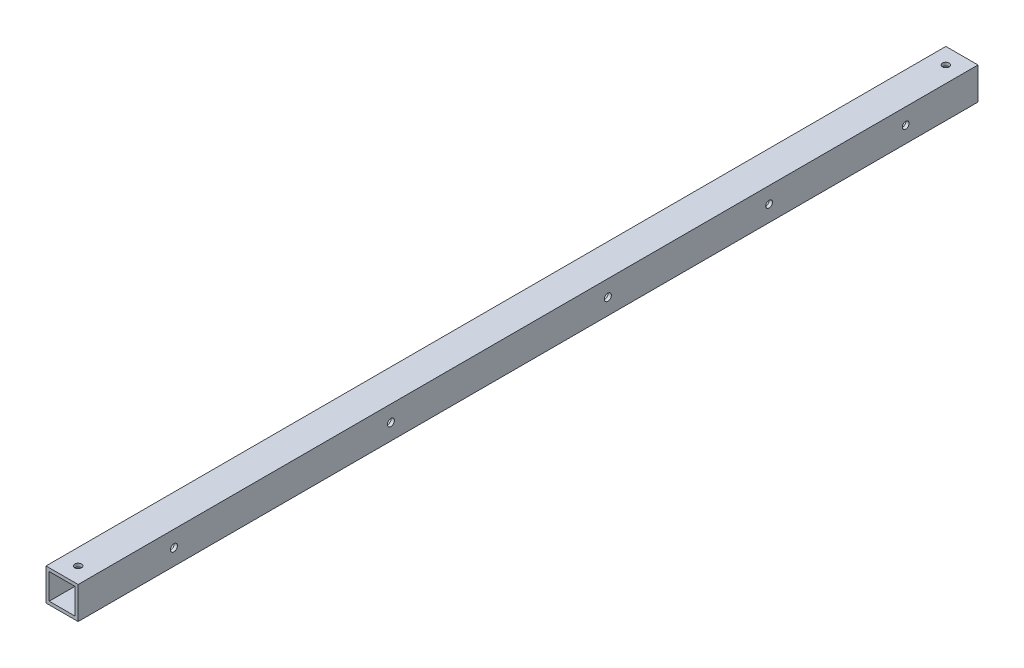
ISO-10303-21;
HEADER;
FILE_DESCRIPTION(('STEP AP214'),'2;1');
FILE_NAME('part.step','',(''),(''),'','','');
FILE_SCHEMA(('AUTOMOTIVE_DESIGN { 1 0 10303 214 1 1 1 1 }'));
ENDSEC;
DATA;
#1=APPLICATION_CONTEXT('core data for automotive mechanical design processes');
#2=APPLICATION_PROTOCOL_DEFINITION('international standard','automotive_design',2000,#1);
#3=PRODUCT_CONTEXT('',#1,'mechanical');
#4=PRODUCT('Part','Part','',(#3));
#5=PRODUCT_RELATED_PRODUCT_CATEGORY('part','',(#4));
#6=PRODUCT_DEFINITION_FORMATION('','',#4);
#7=PRODUCT_DEFINITION_CONTEXT('part definition',#1,'design');
#8=PRODUCT_DEFINITION('design','',#6,#7);
#9=PRODUCT_DEFINITION_SHAPE('','',#8);
#10=(LENGTH_UNIT() NAMED_UNIT(*) SI_UNIT(.MILLI.,.METRE.));
#11=(NAMED_UNIT(*) PLANE_ANGLE_UNIT() SI_UNIT($,.RADIAN.));
#12=(NAMED_UNIT(*) SI_UNIT($,.STERADIAN.) SOLID_ANGLE_UNIT());
#13=UNCERTAINTY_MEASURE_WITH_UNIT(LENGTH_MEASURE(1.E-05),#10,'distance_accuracy_value','');
#14=(GEOMETRIC_REPRESENTATION_CONTEXT(3) GLOBAL_UNCERTAINTY_ASSIGNED_CONTEXT((#13)) GLOBAL_UNIT_ASSIGNED_CONTEXT((#10,
#11,#12)) REPRESENTATION_CONTEXT('',''));
#15=CARTESIAN_POINT('',(0.,0.,0.));
#16=DIRECTION('',(0.,0.,1.));
#17=DIRECTION('',(1.,0.,0.));
#18=AXIS2_PLACEMENT_3D('',#15,#16,#17);
#19=CARTESIAN_POINT('',(0.,0.,560.));
#20=DIRECTION('',(0.,0.,1.));
#21=DIRECTION('',(1.,0.,0.));
#22=AXIS2_PLACEMENT_3D('',#19,#20,#21);
#23=PLANE('',#22);
#24=DIRECTION('',(0.,1.,0.));
#25=VECTOR('',#24,1.);
#26=CARTESIAN_POINT('',(10.,10.,560.));
#27=LINE('',#26,#25);
#28=CARTESIAN_POINT('',(10.,-10.,560.));
#29=VERTEX_POINT('',#28);
#30=CARTESIAN_POINT('',(10.,10.,560.));
#31=VERTEX_POINT('',#30);
#32=EDGE_CURVE('E137',#29,#31,#27,.T.);
#33=ORIENTED_EDGE('',*,*,#32,.T.);
#34=DIRECTION('',(-1.,0.,0.));
#35=VECTOR('',#34,1.);
#36=CARTESIAN_POINT('',(-10.,10.,560.));
#37=LINE('',#36,#35);
#38=CARTESIAN_POINT('',(-10.,10.,560.));
#39=VERTEX_POINT('',#38);
#40=EDGE_CURVE('E140',#31,#39,#37,.T.);
#41=ORIENTED_EDGE('',*,*,#40,.T.);
#42=DIRECTION('',(0.,-1.,0.));
#43=VECTOR('',#42,1.);
#44=CARTESIAN_POINT('',(-10.,10.,560.));
#45=LINE('',#44,#43);
#46=CARTESIAN_POINT('',(-10.,-10.,560.));
#47=VERTEX_POINT('',#46);
#48=EDGE_CURVE('E143',#39,#47,#45,.T.);
#49=ORIENTED_EDGE('',*,*,#48,.T.);
#50=DIRECTION('',(1.,0.,0.));
#51=VECTOR('',#50,1.);
#52=CARTESIAN_POINT('',(-10.,-10.,560.));
#53=LINE('',#52,#51);
#54=EDGE_CURVE('E145',#47,#29,#53,.T.);
#55=ORIENTED_EDGE('',*,*,#54,.T.);
#56=EDGE_LOOP('',(#33,#41,#49,#55));
#57=FACE_BOUND('',#56,.T.);
#58=DIRECTION('',(-1.,0.,0.));
#59=VECTOR('',#58,1.);
#60=CARTESIAN_POINT('',(-8.,8.,560.));
#61=LINE('',#60,#59);
#62=CARTESIAN_POINT('',(8.,8.,560.));
#63=VERTEX_POINT('',#62);
#64=CARTESIAN_POINT('',(-8.,8.,560.));
#65=VERTEX_POINT('',#64);
#66=EDGE_CURVE('E107',#63,#65,#61,.T.);
#67=ORIENTED_EDGE('',*,*,#66,.F.);
#68=DIRECTION('',(0.,1.,0.));
#69=VECTOR('',#68,1.);
#70=CARTESIAN_POINT('',(8.,8.,560.));
#71=LINE('',#70,#69);
#72=CARTESIAN_POINT('',(8.,-8.,560.));
#73=VERTEX_POINT('',#72);
#74=EDGE_CURVE('E99',#73,#63,#71,.T.);
#75=ORIENTED_EDGE('',*,*,#74,.F.);
#76=DIRECTION('',(1.,0.,0.));
#77=VECTOR('',#76,1.);
#78=CARTESIAN_POINT('',(-8.,-8.,560.));
#79=LINE('',#78,#77);
#80=CARTESIAN_POINT('',(-8.,-8.,560.));
#81=VERTEX_POINT('',#80);
#82=EDGE_CURVE('E121',#81,#73,#79,.T.);
#83=ORIENTED_EDGE('',*,*,#82,.F.);
#84=DIRECTION('',(0.,-1.,0.));
#85=VECTOR('',#84,1.);
#86=CARTESIAN_POINT('',(-8.,8.,560.));
#87=LINE('',#86,#85);
#88=EDGE_CURVE('E119',#65,#81,#87,.T.);
#89=ORIENTED_EDGE('',*,*,#88,.F.);
#90=EDGE_LOOP('',(#67,#75,#83,#89));
#91=FACE_BOUND('',#90,.T.);
#92=ADVANCED_FACE('F32',(#57,#91),#23,.T.);
#93=CARTESIAN_POINT('',(0.,0.,0.));
#94=DIRECTION('',(0.,0.,1.));
#95=DIRECTION('',(1.,0.,0.));
#96=AXIS2_PLACEMENT_3D('',#93,#94,#95);
#97=PLANE('',#96);
#98=DIRECTION('',(0.,1.,0.));
#99=VECTOR('',#98,1.);
#100=CARTESIAN_POINT('',(10.,10.,0.));
#101=LINE('',#100,#99);
#102=CARTESIAN_POINT('',(10.,-10.,0.));
#103=VERTEX_POINT('',#102);
#104=CARTESIAN_POINT('',(10.,10.,0.));
#105=VERTEX_POINT('',#104);
#106=EDGE_CURVE('E115',#103,#105,#101,.T.);
#107=ORIENTED_EDGE('',*,*,#106,.F.);
#108=DIRECTION('',(1.,0.,0.));
#109=VECTOR('',#108,1.);
#110=CARTESIAN_POINT('',(-10.,-10.,0.));
#111=LINE('',#110,#109);
#112=CARTESIAN_POINT('',(-10.,-10.,0.));
#113=VERTEX_POINT('',#112);
#114=EDGE_CURVE('E141',#113,#103,#111,.T.);
#115=ORIENTED_EDGE('',*,*,#114,.F.);
#116=DIRECTION('',(0.,-1.,0.));
#117=VECTOR('',#116,1.);
#118=CARTESIAN_POINT('',(-10.,10.,0.));
#119=LINE('',#118,#117);
#120=CARTESIAN_POINT('',(-10.,10.,0.));
#121=VERTEX_POINT('',#120);
#122=EDGE_CURVE('E152',#121,#113,#119,.T.);
#123=ORIENTED_EDGE('',*,*,#122,.F.);
#124=DIRECTION('',(-1.,0.,0.));
#125=VECTOR('',#124,1.);
#126=CARTESIAN_POINT('',(-10.,10.,0.));
#127=LINE('',#126,#125);
#128=EDGE_CURVE('E150',#105,#121,#127,.T.);
#129=ORIENTED_EDGE('',*,*,#128,.F.);
#130=EDGE_LOOP('',(#107,#115,#123,#129));
#131=FACE_BOUND('',#130,.T.);
#132=DIRECTION('',(0.,1.,0.));
#133=VECTOR('',#132,1.);
#134=CARTESIAN_POINT('',(8.,8.,0.));
#135=LINE('',#134,#133);
#136=CARTESIAN_POINT('',(8.,-8.,0.));
#137=VERTEX_POINT('',#136);
#138=CARTESIAN_POINT('',(8.,8.,0.));
#139=VERTEX_POINT('',#138);
#140=EDGE_CURVE('E57',#137,#139,#135,.T.);
#141=ORIENTED_EDGE('',*,*,#140,.T.);
#142=DIRECTION('',(-1.,0.,0.));
#143=VECTOR('',#142,1.);
#144=CARTESIAN_POINT('',(-8.,8.,0.));
#145=LINE('',#144,#143);
#146=CARTESIAN_POINT('',(-8.,8.,0.));
#147=VERTEX_POINT('',#146);
#148=EDGE_CURVE('E114',#139,#147,#145,.T.);
#149=ORIENTED_EDGE('',*,*,#148,.T.);
#150=DIRECTION('',(0.,-1.,0.));
#151=VECTOR('',#150,1.);
#152=CARTESIAN_POINT('',(-8.,8.,0.));
#153=LINE('',#152,#151);
#154=CARTESIAN_POINT('',(-8.,-8.,0.));
#155=VERTEX_POINT('',#154);
#156=EDGE_CURVE('E129',#147,#155,#153,.T.);
#157=ORIENTED_EDGE('',*,*,#156,.T.);
#158=DIRECTION('',(1.,0.,0.));
#159=VECTOR('',#158,1.);
#160=CARTESIAN_POINT('',(-8.,-8.,0.));
#161=LINE('',#160,#159);
#162=EDGE_CURVE('E108',#155,#137,#161,.T.);
#163=ORIENTED_EDGE('',*,*,#162,.T.);
#164=EDGE_LOOP('',(#141,#149,#157,#163));
#165=FACE_BOUND('',#164,.T.);
#166=ADVANCED_FACE('F249',(#131,#165),#97,.F.);
#167=CARTESIAN_POINT('',(10.,10.,560.));
#168=DIRECTION('',(-1.,0.,0.));
#169=DIRECTION('',(0.,-1.,0.));
#170=AXIS2_PLACEMENT_3D('',#167,#168,#169);
#171=PLANE('',#170);
#172=CARTESIAN_POINT('',(10.,0.,130.));
#173=DIRECTION('',(1.,0.,0.));
#174=DIRECTION('',(0.,1.,0.));
#175=AXIS2_PLACEMENT_3D('',#172,#173,#174);
#176=CIRCLE('',#175,2.09999999999999);
#177=CARTESIAN_POINT('',(10.,2.09999999999998,130.));
#178=VERTEX_POINT('',#177);
#179=EDGE_CURVE('E183',#178,#178,#176,.T.);
#180=ORIENTED_EDGE('',*,*,#179,.F.);
#181=EDGE_LOOP('',(#180));
#182=FACE_BOUND('',#181,.T.);
#183=CARTESIAN_POINT('',(10.,0.,45.));
#184=DIRECTION('',(1.,0.,0.));
#185=DIRECTION('',(0.,1.,0.));
#186=AXIS2_PLACEMENT_3D('',#183,#184,#185);
#187=CIRCLE('',#186,2.1);
#188=CARTESIAN_POINT('',(10.,2.1,45.));
#189=VERTEX_POINT('',#188);
#190=EDGE_CURVE('E190',#189,#189,#187,.T.);
#191=ORIENTED_EDGE('',*,*,#190,.F.);
#192=EDGE_LOOP('',(#191));
#193=FACE_BOUND('',#192,.T.);
#194=CARTESIAN_POINT('',(10.,0.,500.38));
#195=DIRECTION('',(1.,0.,0.));
#196=DIRECTION('',(0.,1.,0.));
#197=AXIS2_PLACEMENT_3D('',#194,#195,#196);
#198=CIRCLE('',#197,2.19999999999998);
#199=CARTESIAN_POINT('',(10.,2.19999999999999,500.38));
#200=VERTEX_POINT('',#199);
#201=EDGE_CURVE('E208',#200,#200,#198,.T.);
#202=ORIENTED_EDGE('',*,*,#201,.F.);
#203=EDGE_LOOP('',(#202));
#204=FACE_BOUND('',#203,.T.);
#205=CARTESIAN_POINT('',(10.,0.,365.38));
#206=DIRECTION('',(1.,0.,0.));
#207=DIRECTION('',(0.,1.,0.));
#208=AXIS2_PLACEMENT_3D('',#205,#206,#207);
#209=CIRCLE('',#208,2.19999999999998);
#210=CARTESIAN_POINT('',(10.,2.19999999999999,365.38));
#211=VERTEX_POINT('',#210);
#212=EDGE_CURVE('E214',#211,#211,#209,.T.);
#213=ORIENTED_EDGE('',*,*,#212,.F.);
#214=EDGE_LOOP('',(#213));
#215=FACE_BOUND('',#214,.T.);
#216=CARTESIAN_POINT('',(10.,0.,230.38));
#217=DIRECTION('',(1.,0.,0.));
#218=DIRECTION('',(0.,1.,0.));
#219=AXIS2_PLACEMENT_3D('',#216,#217,#218);
#220=CIRCLE('',#219,2.20000000000001);
#221=CARTESIAN_POINT('',(10.,2.20000000000002,230.38));
#222=VERTEX_POINT('',#221);
#223=EDGE_CURVE('E205',#222,#222,#220,.T.);
#224=ORIENTED_EDGE('',*,*,#223,.F.);
#225=EDGE_LOOP('',(#224));
#226=FACE_BOUND('',#225,.T.);
#227=ORIENTED_EDGE('',*,*,#106,.T.);
#228=DIRECTION('',(0.,0.,-1.));
#229=VECTOR('',#228,1.);
#230=CARTESIAN_POINT('',(10.,10.,560.));
#231=LINE('',#230,#229);
#232=EDGE_CURVE('E11',#31,#105,#231,.T.);
#233=ORIENTED_EDGE('',*,*,#232,.F.);
#234=ORIENTED_EDGE('',*,*,#32,.F.);
#235=DIRECTION('',(0.,0.,-1.));
#236=VECTOR('',#235,1.);
#237=CARTESIAN_POINT('',(10.,-10.,560.));
#238=LINE('',#237,#236);
#239=EDGE_CURVE('E147',#29,#103,#238,.T.);
#240=ORIENTED_EDGE('',*,*,#239,.T.);
#241=EDGE_LOOP('',(#227,#233,#234,#240));
#242=FACE_BOUND('',#241,.T.);
#243=ADVANCED_FACE('F34',(#182,#193,#204,#215,#226,#242),#171,.F.);
#244=CARTESIAN_POINT('',(-10.,10.,560.));
#245=DIRECTION('',(0.,-1.,0.));
#246=DIRECTION('',(0.,0.,-1.));
#247=AXIS2_PLACEMENT_3D('',#244,#245,#246);
#248=PLANE('',#247);
#249=CARTESIAN_POINT('',(0.,10.,550.));
#250=DIRECTION('',(0.,1.,0.));
#251=DIRECTION('',(0.,0.,1.));
#252=AXIS2_PLACEMENT_3D('',#249,#250,#251);
#253=CIRCLE('',#252,2.10000000000001);
#254=CARTESIAN_POINT('',(0.,10.,552.1));
#255=VERTEX_POINT('',#254);
#256=EDGE_CURVE('E165',#255,#255,#253,.T.);
#257=ORIENTED_EDGE('',*,*,#256,.F.);
#258=EDGE_LOOP('',(#257));
#259=FACE_BOUND('',#258,.T.);
#260=CARTESIAN_POINT('',(0.,10.,10.));
#261=DIRECTION('',(0.,1.,0.));
#262=DIRECTION('',(0.,0.,1.));
#263=AXIS2_PLACEMENT_3D('',#260,#261,#262);
#264=CIRCLE('',#263,2.1);
#265=CARTESIAN_POINT('',(0.,10.,12.1));
#266=VERTEX_POINT('',#265);
#267=EDGE_CURVE('E228',#266,#266,#264,.T.);
#268=ORIENTED_EDGE('',*,*,#267,.F.);
#269=EDGE_LOOP('',(#268));
#270=FACE_BOUND('',#269,.T.);
#271=ORIENTED_EDGE('',*,*,#128,.T.);
#272=DIRECTION('',(0.,0.,-1.));
#273=VECTOR('',#272,1.);
#274=CARTESIAN_POINT('',(-10.,10.,560.));
#275=LINE('',#274,#273);
#276=EDGE_CURVE('E41',#39,#121,#275,.T.);
#277=ORIENTED_EDGE('',*,*,#276,.F.);
#278=ORIENTED_EDGE('',*,*,#40,.F.);
#279=ORIENTED_EDGE('',*,*,#232,.T.);
#280=EDGE_LOOP('',(#271,#277,#278,#279));
#281=FACE_BOUND('',#280,.T.);
#282=ADVANCED_FACE('F235',(#259,#270,#281),#248,.F.);
#283=CARTESIAN_POINT('',(-10.,10.,560.));
#284=DIRECTION('',(1.,0.,0.));
#285=DIRECTION('',(0.,1.,0.));
#286=AXIS2_PLACEMENT_3D('',#283,#284,#285);
#287=PLANE('',#286);
#288=CARTESIAN_POINT('',(-10.,0.,130.));
#289=DIRECTION('',(1.,0.,0.));
#290=DIRECTION('',(0.,1.,0.));
#291=AXIS2_PLACEMENT_3D('',#288,#289,#290);
#292=CIRCLE('',#291,2.09999999999999);
#293=CARTESIAN_POINT('',(-10.,2.09999999999998,130.));
#294=VERTEX_POINT('',#293);
#295=EDGE_CURVE('E202',#294,#294,#292,.T.);
#296=ORIENTED_EDGE('',*,*,#295,.T.);
#297=EDGE_LOOP('',(#296));
#298=FACE_BOUND('',#297,.T.);
#299=CARTESIAN_POINT('',(-10.,0.,45.));
#300=DIRECTION('',(1.,0.,0.));
#301=DIRECTION('',(0.,1.,0.));
#302=AXIS2_PLACEMENT_3D('',#299,#300,#301);
#303=CIRCLE('',#302,2.1);
#304=CARTESIAN_POINT('',(-10.,2.1,45.));
#305=VERTEX_POINT('',#304);
#306=EDGE_CURVE('E187',#305,#305,#303,.T.);
#307=ORIENTED_EDGE('',*,*,#306,.T.);
#308=EDGE_LOOP('',(#307));
#309=FACE_BOUND('',#308,.T.);
#310=CARTESIAN_POINT('',(-10.,0.,500.38));
#311=DIRECTION('',(1.,0.,0.));
#312=DIRECTION('',(0.,1.,0.));
#313=AXIS2_PLACEMENT_3D('',#310,#311,#312);
#314=CIRCLE('',#313,2.19999999999998);
#315=CARTESIAN_POINT('',(-10.,2.19999999999998,500.38));
#316=VERTEX_POINT('',#315);
#317=EDGE_CURVE('E172',#316,#316,#314,.T.);
#318=ORIENTED_EDGE('',*,*,#317,.T.);
#319=EDGE_LOOP('',(#318));
#320=FACE_BOUND('',#319,.T.);
#321=CARTESIAN_POINT('',(-10.,0.,365.38));
#322=DIRECTION('',(1.,0.,0.));
#323=DIRECTION('',(0.,1.,0.));
#324=AXIS2_PLACEMENT_3D('',#321,#322,#323);
#325=CIRCLE('',#324,2.19999999999998);
#326=CARTESIAN_POINT('',(-10.,2.19999999999998,365.38));
#327=VERTEX_POINT('',#326);
#328=EDGE_CURVE('E211',#327,#327,#325,.T.);
#329=ORIENTED_EDGE('',*,*,#328,.T.);
#330=EDGE_LOOP('',(#329));
#331=FACE_BOUND('',#330,.T.);
#332=CARTESIAN_POINT('',(-10.,0.,230.38));
#333=DIRECTION('',(1.,0.,0.));
#334=DIRECTION('',(0.,1.,0.));
#335=AXIS2_PLACEMENT_3D('',#332,#333,#334);
#336=CIRCLE('',#335,2.20000000000001);
#337=CARTESIAN_POINT('',(-10.,2.20000000000001,230.38));
#338=VERTEX_POINT('',#337);
#339=EDGE_CURVE('E217',#338,#338,#336,.T.);
#340=ORIENTED_EDGE('',*,*,#339,.T.);
#341=EDGE_LOOP('',(#340));
#342=FACE_BOUND('',#341,.T.);
#343=ORIENTED_EDGE('',*,*,#122,.T.);
#344=DIRECTION('',(0.,0.,-1.));
#345=VECTOR('',#344,1.);
#346=CARTESIAN_POINT('',(-10.,-10.,560.));
#347=LINE('',#346,#345);
#348=EDGE_CURVE('E157',#47,#113,#347,.T.);
#349=ORIENTED_EDGE('',*,*,#348,.F.);
#350=ORIENTED_EDGE('',*,*,#48,.F.);
#351=ORIENTED_EDGE('',*,*,#276,.T.);
#352=EDGE_LOOP('',(#343,#349,#350,#351));
#353=FACE_BOUND('',#352,.T.);
#354=ADVANCED_FACE('F238',(#298,#309,#320,#331,#342,#353),#287,.F.);
#355=CARTESIAN_POINT('',(-10.,-10.,560.));
#356=DIRECTION('',(0.,1.,0.));
#357=DIRECTION('',(0.,0.,1.));
#358=AXIS2_PLACEMENT_3D('',#355,#356,#357);
#359=PLANE('',#358);
#360=ORIENTED_EDGE('',*,*,#114,.T.);
#361=ORIENTED_EDGE('',*,*,#239,.F.);
#362=ORIENTED_EDGE('',*,*,#54,.F.);
#363=ORIENTED_EDGE('',*,*,#348,.T.);
#364=EDGE_LOOP('',(#360,#361,#362,#363));
#365=FACE_BOUND('',#364,.T.);
#366=ADVANCED_FACE('F253',(#365),#359,.F.);
#367=CARTESIAN_POINT('',(8.,8.,560.));
#368=DIRECTION('',(-1.,0.,0.));
#369=DIRECTION('',(0.,-1.,0.));
#370=AXIS2_PLACEMENT_3D('',#367,#368,#369);
#371=PLANE('',#370);
#372=CARTESIAN_POINT('',(8.,0.,130.));
#373=DIRECTION('',(-1.,0.,0.));
#374=DIRECTION('',(0.,-1.,0.));
#375=AXIS2_PLACEMENT_3D('',#372,#373,#374);
#376=CIRCLE('',#375,2.09999999999999);
#377=CARTESIAN_POINT('',(8.,-2.1,130.));
#378=VERTEX_POINT('',#377);
#379=EDGE_CURVE('E199',#378,#378,#376,.T.);
#380=ORIENTED_EDGE('',*,*,#379,.F.);
#381=EDGE_LOOP('',(#380));
#382=FACE_BOUND('',#381,.T.);
#383=CARTESIAN_POINT('',(8.,0.,45.));
#384=DIRECTION('',(-1.,0.,0.));
#385=DIRECTION('',(0.,-1.,0.));
#386=AXIS2_PLACEMENT_3D('',#383,#384,#385);
#387=CIRCLE('',#386,2.1);
#388=CARTESIAN_POINT('',(8.,-2.09999999999999,45.));
#389=VERTEX_POINT('',#388);
#390=EDGE_CURVE('E182',#389,#389,#387,.T.);
#391=ORIENTED_EDGE('',*,*,#390,.F.);
#392=EDGE_LOOP('',(#391));
#393=FACE_BOUND('',#392,.T.);
#394=CARTESIAN_POINT('',(8.,0.,500.38));
#395=DIRECTION('',(-1.,0.,0.));
#396=DIRECTION('',(0.,-1.,0.));
#397=AXIS2_PLACEMENT_3D('',#394,#395,#396);
#398=CIRCLE('',#397,2.19999999999998);
#399=CARTESIAN_POINT('',(8.,-2.19999999999998,500.38));
#400=VERTEX_POINT('',#399);
#401=EDGE_CURVE('E179',#400,#400,#398,.T.);
#402=ORIENTED_EDGE('',*,*,#401,.F.);
#403=EDGE_LOOP('',(#402));
#404=FACE_BOUND('',#403,.T.);
#405=CARTESIAN_POINT('',(8.,0.,365.38));
#406=DIRECTION('',(-1.,0.,0.));
#407=DIRECTION('',(0.,-1.,0.));
#408=AXIS2_PLACEMENT_3D('',#405,#406,#407);
#409=CIRCLE('',#408,2.19999999999998);
#410=CARTESIAN_POINT('',(8.,-2.19999999999998,365.38));
#411=VERTEX_POINT('',#410);
#412=EDGE_CURVE('E176',#411,#411,#409,.T.);
#413=ORIENTED_EDGE('',*,*,#412,.F.);
#414=EDGE_LOOP('',(#413));
#415=FACE_BOUND('',#414,.T.);
#416=CARTESIAN_POINT('',(8.,0.,230.38));
#417=DIRECTION('',(-1.,0.,0.));
#418=DIRECTION('',(0.,-1.,0.));
#419=AXIS2_PLACEMENT_3D('',#416,#417,#418);
#420=CIRCLE('',#419,2.20000000000001);
#421=CARTESIAN_POINT('',(8.,-2.20000000000001,230.38));
#422=VERTEX_POINT('',#421);
#423=EDGE_CURVE('E171',#422,#422,#420,.T.);
#424=ORIENTED_EDGE('',*,*,#423,.F.);
#425=EDGE_LOOP('',(#424));
#426=FACE_BOUND('',#425,.T.);
#427=ORIENTED_EDGE('',*,*,#140,.F.);
#428=DIRECTION('',(0.,0.,-1.));
#429=VECTOR('',#428,1.);
#430=CARTESIAN_POINT('',(8.,-8.,560.));
#431=LINE('',#430,#429);
#432=EDGE_CURVE('E103',#73,#137,#431,.T.);
#433=ORIENTED_EDGE('',*,*,#432,.F.);
#434=ORIENTED_EDGE('',*,*,#74,.T.);
#435=DIRECTION('',(0.,0.,-1.));
#436=VECTOR('',#435,1.);
#437=CARTESIAN_POINT('',(8.,8.,560.));
#438=LINE('',#437,#436);
#439=EDGE_CURVE('E102',#63,#139,#438,.T.);
#440=ORIENTED_EDGE('',*,*,#439,.T.);
#441=EDGE_LOOP('',(#427,#433,#434,#440));
#442=FACE_BOUND('',#441,.T.);
#443=ADVANCED_FACE('F101',(#382,#393,#404,#415,#426,#442),#371,.T.);
#444=CARTESIAN_POINT('',(-8.,8.,560.));
#445=DIRECTION('',(0.,-1.,0.));
#446=DIRECTION('',(0.,0.,-1.));
#447=AXIS2_PLACEMENT_3D('',#444,#445,#446);
#448=PLANE('',#447);
#449=CARTESIAN_POINT('',(0.,8.,550.));
#450=DIRECTION('',(0.,-1.,0.));
#451=DIRECTION('',(0.,0.,-1.));
#452=AXIS2_PLACEMENT_3D('',#449,#450,#451);
#453=CIRCLE('',#452,2.10000000000001);
#454=CARTESIAN_POINT('',(0.,8.,547.9));
#455=VERTEX_POINT('',#454);
#456=EDGE_CURVE('E127',#455,#455,#453,.T.);
#457=ORIENTED_EDGE('',*,*,#456,.F.);
#458=EDGE_LOOP('',(#457));
#459=FACE_BOUND('',#458,.T.);
#460=CARTESIAN_POINT('',(0.,8.,10.));
#461=DIRECTION('',(0.,-1.,0.));
#462=DIRECTION('',(0.,0.,-1.));
#463=AXIS2_PLACEMENT_3D('',#460,#461,#462);
#464=CIRCLE('',#463,2.1);
#465=CARTESIAN_POINT('',(0.,8.,7.9));
#466=VERTEX_POINT('',#465);
#467=EDGE_CURVE('E162',#466,#466,#464,.T.);
#468=ORIENTED_EDGE('',*,*,#467,.F.);
#469=EDGE_LOOP('',(#468));
#470=FACE_BOUND('',#469,.T.);
#471=ORIENTED_EDGE('',*,*,#148,.F.);
#472=ORIENTED_EDGE('',*,*,#439,.F.);
#473=ORIENTED_EDGE('',*,*,#66,.T.);
#474=DIRECTION('',(0.,0.,-1.));
#475=VECTOR('',#474,1.);
#476=CARTESIAN_POINT('',(-8.,8.,560.));
#477=LINE('',#476,#475);
#478=EDGE_CURVE('E116',#65,#147,#477,.T.);
#479=ORIENTED_EDGE('',*,*,#478,.T.);
#480=EDGE_LOOP('',(#471,#472,#473,#479));
#481=FACE_BOUND('',#480,.T.);
#482=ADVANCED_FACE('F111',(#459,#470,#481),#448,.T.);
#483=CARTESIAN_POINT('',(-8.,8.,560.));
#484=DIRECTION('',(1.,0.,0.));
#485=DIRECTION('',(0.,0.,-1.));
#486=AXIS2_PLACEMENT_3D('',#483,#484,#485);
#487=PLANE('',#486);
#488=CARTESIAN_POINT('',(-8.,0.,130.));
#489=DIRECTION('',(1.,0.,0.));
#490=DIRECTION('',(0.,0.,-1.));
#491=AXIS2_PLACEMENT_3D('',#488,#489,#490);
#492=CIRCLE('',#491,2.09999999999999);
#493=CARTESIAN_POINT('',(-8.,0.,127.9));
#494=VERTEX_POINT('',#493);
#495=EDGE_CURVE('E36',#494,#494,#492,.T.);
#496=ORIENTED_EDGE('',*,*,#495,.F.);
#497=EDGE_LOOP('',(#496));
#498=FACE_BOUND('',#497,.T.);
#499=CARTESIAN_POINT('',(-8.,0.,45.));
#500=DIRECTION('',(1.,0.,0.));
#501=DIRECTION('',(0.,0.,-1.));
#502=AXIS2_PLACEMENT_3D('',#499,#500,#501);
#503=CIRCLE('',#502,2.1);
#504=CARTESIAN_POINT('',(-8.,0.,42.9));
#505=VERTEX_POINT('',#504);
#506=EDGE_CURVE('E180',#505,#505,#503,.T.);
#507=ORIENTED_EDGE('',*,*,#506,.F.);
#508=EDGE_LOOP('',(#507));
#509=FACE_BOUND('',#508,.T.);
#510=CARTESIAN_POINT('',(-8.,0.,500.38));
#511=DIRECTION('',(1.,0.,0.));
#512=DIRECTION('',(0.,0.,-1.));
#513=AXIS2_PLACEMENT_3D('',#510,#511,#512);
#514=CIRCLE('',#513,2.19999999999998);
#515=CARTESIAN_POINT('',(-8.,0.,498.18));
#516=VERTEX_POINT('',#515);
#517=EDGE_CURVE('E177',#516,#516,#514,.T.);
#518=ORIENTED_EDGE('',*,*,#517,.F.);
#519=EDGE_LOOP('',(#518));
#520=FACE_BOUND('',#519,.T.);
#521=CARTESIAN_POINT('',(-8.,0.,365.38));
#522=DIRECTION('',(1.,0.,0.));
#523=DIRECTION('',(0.,0.,-1.));
#524=AXIS2_PLACEMENT_3D('',#521,#522,#523);
#525=CIRCLE('',#524,2.19999999999998);
#526=CARTESIAN_POINT('',(-8.,0.,363.18));
#527=VERTEX_POINT('',#526);
#528=EDGE_CURVE('E173',#527,#527,#525,.T.);
#529=ORIENTED_EDGE('',*,*,#528,.F.);
#530=EDGE_LOOP('',(#529));
#531=FACE_BOUND('',#530,.T.);
#532=CARTESIAN_POINT('',(-8.,0.,230.38));
#533=DIRECTION('',(1.,0.,0.));
#534=DIRECTION('',(0.,0.,-1.));
#535=AXIS2_PLACEMENT_3D('',#532,#533,#534);
#536=CIRCLE('',#535,2.20000000000001);
#537=CARTESIAN_POINT('',(-8.,0.,228.18));
#538=VERTEX_POINT('',#537);
#539=EDGE_CURVE('E168',#538,#538,#536,.T.);
#540=ORIENTED_EDGE('',*,*,#539,.F.);
#541=EDGE_LOOP('',(#540));
#542=FACE_BOUND('',#541,.T.);
#543=ORIENTED_EDGE('',*,*,#156,.F.);
#544=ORIENTED_EDGE('',*,*,#478,.F.);
#545=ORIENTED_EDGE('',*,*,#88,.T.);
#546=DIRECTION('',(0.,0.,-1.));
#547=VECTOR('',#546,1.);
#548=CARTESIAN_POINT('',(-8.,-8.,560.));
#549=LINE('',#548,#547);
#550=EDGE_CURVE('E49',#81,#155,#549,.T.);
#551=ORIENTED_EDGE('',*,*,#550,.T.);
#552=EDGE_LOOP('',(#543,#544,#545,#551));
#553=FACE_BOUND('',#552,.T.);
#554=ADVANCED_FACE('F364',(#498,#509,#520,#531,#542,#553),#487,.T.);
#555=CARTESIAN_POINT('',(-8.,-8.,560.));
#556=DIRECTION('',(0.,1.,0.));
#557=DIRECTION('',(0.,0.,1.));
#558=AXIS2_PLACEMENT_3D('',#555,#556,#557);
#559=PLANE('',#558);
#560=ORIENTED_EDGE('',*,*,#162,.F.);
#561=ORIENTED_EDGE('',*,*,#550,.F.);
#562=ORIENTED_EDGE('',*,*,#82,.T.);
#563=ORIENTED_EDGE('',*,*,#432,.T.);
#564=EDGE_LOOP('',(#560,#561,#562,#563));
#565=FACE_BOUND('',#564,.T.);
#566=ADVANCED_FACE('F369',(#565),#559,.T.);
#567=CARTESIAN_POINT('',(0.,0.,10.));
#568=DIRECTION('',(0.,1.,0.));
#569=DIRECTION('',(0.,0.,1.));
#570=AXIS2_PLACEMENT_3D('',#567,#568,#569);
#571=CYLINDRICAL_SURFACE('',#570,2.1);
#572=ORIENTED_EDGE('',*,*,#467,.T.);
#573=EDGE_LOOP('',(#572));
#574=FACE_BOUND('',#573,.T.);
#575=ORIENTED_EDGE('',*,*,#267,.T.);
#576=EDGE_LOOP('',(#575));
#577=FACE_BOUND('',#576,.T.);
#578=ADVANCED_FACE('F233',(#574,#577),#571,.F.);
#579=CARTESIAN_POINT('',(0.,0.,550.));
#580=DIRECTION('',(0.,1.,0.));
#581=DIRECTION('',(0.,0.,1.));
#582=AXIS2_PLACEMENT_3D('',#579,#580,#581);
#583=CYLINDRICAL_SURFACE('',#582,2.10000000000001);
#584=ORIENTED_EDGE('',*,*,#456,.T.);
#585=EDGE_LOOP('',(#584));
#586=FACE_BOUND('',#585,.T.);
#587=ORIENTED_EDGE('',*,*,#256,.T.);
#588=EDGE_LOOP('',(#587));
#589=FACE_BOUND('',#588,.T.);
#590=ADVANCED_FACE('F288',(#586,#589),#583,.F.);
#591=CARTESIAN_POINT('',(-10.,0.,230.38));
#592=DIRECTION('',(1.,0.,0.));
#593=DIRECTION('',(0.,1.,0.));
#594=AXIS2_PLACEMENT_3D('',#591,#592,#593);
#595=CYLINDRICAL_SURFACE('',#594,2.20000000000001);
#596=ORIENTED_EDGE('',*,*,#539,.T.);
#597=EDGE_LOOP('',(#596));
#598=FACE_BOUND('',#597,.T.);
#599=ORIENTED_EDGE('',*,*,#339,.F.);
#600=EDGE_LOOP('',(#599));
#601=FACE_BOUND('',#600,.T.);
#602=ADVANCED_FACE('F285',(#598,#601),#595,.F.);
#603=CARTESIAN_POINT('',(-10.,0.,365.38));
#604=DIRECTION('',(1.,0.,0.));
#605=DIRECTION('',(0.,1.,0.));
#606=AXIS2_PLACEMENT_3D('',#603,#604,#605);
#607=CYLINDRICAL_SURFACE('',#606,2.19999999999998);
#608=ORIENTED_EDGE('',*,*,#528,.T.);
#609=EDGE_LOOP('',(#608));
#610=FACE_BOUND('',#609,.T.);
#611=ORIENTED_EDGE('',*,*,#328,.F.);
#612=EDGE_LOOP('',(#611));
#613=FACE_BOUND('',#612,.T.);
#614=ADVANCED_FACE('F287',(#610,#613),#607,.F.);
#615=CARTESIAN_POINT('',(-10.,0.,500.38));
#616=DIRECTION('',(1.,0.,0.));
#617=DIRECTION('',(0.,1.,0.));
#618=AXIS2_PLACEMENT_3D('',#615,#616,#617);
#619=CYLINDRICAL_SURFACE('',#618,2.19999999999998);
#620=ORIENTED_EDGE('',*,*,#517,.T.);
#621=EDGE_LOOP('',(#620));
#622=FACE_BOUND('',#621,.T.);
#623=ORIENTED_EDGE('',*,*,#317,.F.);
#624=EDGE_LOOP('',(#623));
#625=FACE_BOUND('',#624,.T.);
#626=ADVANCED_FACE('F296',(#622,#625),#619,.F.);
#627=ORIENTED_EDGE('',*,*,#423,.T.);
#628=EDGE_LOOP('',(#627));
#629=FACE_BOUND('',#628,.T.);
#630=ORIENTED_EDGE('',*,*,#223,.T.);
#631=EDGE_LOOP('',(#630));
#632=FACE_BOUND('',#631,.T.);
#633=ADVANCED_FACE('F291',(#629,#632),#595,.F.);
#634=ORIENTED_EDGE('',*,*,#412,.T.);
#635=EDGE_LOOP('',(#634));
#636=FACE_BOUND('',#635,.T.);
#637=ORIENTED_EDGE('',*,*,#212,.T.);
#638=EDGE_LOOP('',(#637));
#639=FACE_BOUND('',#638,.T.);
#640=ADVANCED_FACE('F299',(#636,#639),#607,.F.);
#641=ORIENTED_EDGE('',*,*,#401,.T.);
#642=EDGE_LOOP('',(#641));
#643=FACE_BOUND('',#642,.T.);
#644=ORIENTED_EDGE('',*,*,#201,.T.);
#645=EDGE_LOOP('',(#644));
#646=FACE_BOUND('',#645,.T.);
#647=ADVANCED_FACE('F308',(#643,#646),#619,.F.);
#648=CARTESIAN_POINT('',(-12.,0.,45.));
#649=DIRECTION('',(1.,0.,0.));
#650=DIRECTION('',(0.,1.,0.));
#651=AXIS2_PLACEMENT_3D('',#648,#649,#650);
#652=CYLINDRICAL_SURFACE('',#651,2.1);
#653=ORIENTED_EDGE('',*,*,#506,.T.);
#654=EDGE_LOOP('',(#653));
#655=FACE_BOUND('',#654,.T.);
#656=ORIENTED_EDGE('',*,*,#306,.F.);
#657=EDGE_LOOP('',(#656));
#658=FACE_BOUND('',#657,.T.);
#659=ADVANCED_FACE('F329',(#655,#658),#652,.F.);
#660=CARTESIAN_POINT('',(-12.,0.,130.));
#661=DIRECTION('',(1.,0.,0.));
#662=DIRECTION('',(0.,1.,0.));
#663=AXIS2_PLACEMENT_3D('',#660,#661,#662);
#664=CYLINDRICAL_SURFACE('',#663,2.09999999999999);
#665=ORIENTED_EDGE('',*,*,#495,.T.);
#666=EDGE_LOOP('',(#665));
#667=FACE_BOUND('',#666,.T.);
#668=ORIENTED_EDGE('',*,*,#295,.F.);
#669=EDGE_LOOP('',(#668));
#670=FACE_BOUND('',#669,.T.);
#671=ADVANCED_FACE('F333',(#667,#670),#664,.F.);
#672=ORIENTED_EDGE('',*,*,#390,.T.);
#673=EDGE_LOOP('',(#672));
#674=FACE_BOUND('',#673,.T.);
#675=ORIENTED_EDGE('',*,*,#190,.T.);
#676=EDGE_LOOP('',(#675));
#677=FACE_BOUND('',#676,.T.);
#678=ADVANCED_FACE('F335',(#674,#677),#652,.F.);
#679=ORIENTED_EDGE('',*,*,#379,.T.);
#680=EDGE_LOOP('',(#679));
#681=FACE_BOUND('',#680,.T.);
#682=ORIENTED_EDGE('',*,*,#179,.T.);
#683=EDGE_LOOP('',(#682));
#684=FACE_BOUND('',#683,.T.);
#685=ADVANCED_FACE('F339',(#681,#684),#664,.F.);
#686=CLOSED_SHELL('',(#92,#166,#243,#282,#354,#366,#443,#482,#554,#566,#578,#590,#602,#614,#626,
#633,#640,#647,#659,#671,#678,#685));
#687=MANIFOLD_SOLID_BREP('B2',#686);
#688=ADVANCED_BREP_SHAPE_REPRESENTATION('',(#18,#687),#14);
#689=SHAPE_DEFINITION_REPRESENTATION(#9,#688);
ENDSEC;
END-ISO-10303-21;
